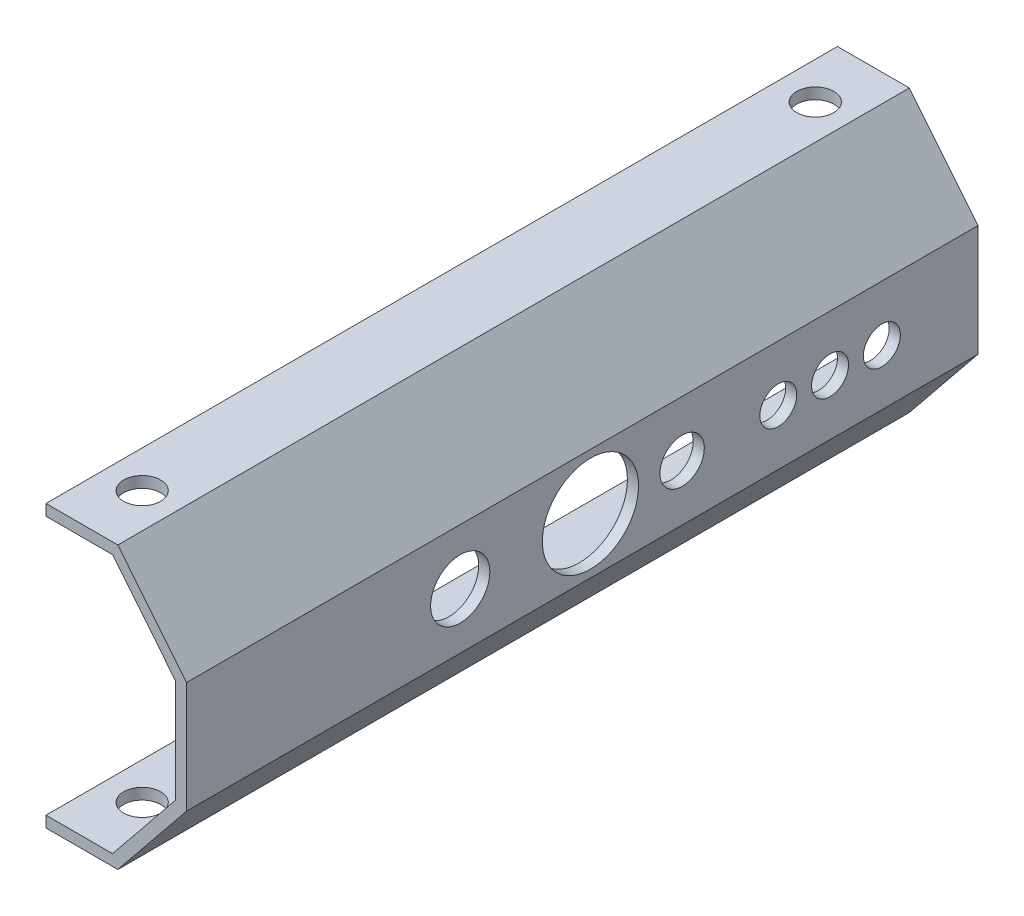
ISO-10303-21;
HEADER;
FILE_DESCRIPTION(('STEP AP214'),'2;1');
FILE_NAME('part.step','',(''),(''),'','','');
FILE_SCHEMA(('AUTOMOTIVE_DESIGN { 1 0 10303 214 1 1 1 1 }'));
ENDSEC;
DATA;
#1=APPLICATION_CONTEXT('core data for automotive mechanical design processes');
#2=APPLICATION_PROTOCOL_DEFINITION('international standard','automotive_design',2000,#1);
#3=PRODUCT_CONTEXT('',#1,'mechanical');
#4=PRODUCT('Part','Part','',(#3));
#5=PRODUCT_RELATED_PRODUCT_CATEGORY('part','',(#4));
#6=PRODUCT_DEFINITION_FORMATION('','',#4);
#7=PRODUCT_DEFINITION_CONTEXT('part definition',#1,'design');
#8=PRODUCT_DEFINITION('design','',#6,#7);
#9=PRODUCT_DEFINITION_SHAPE('','',#8);
#10=(LENGTH_UNIT() NAMED_UNIT(*) SI_UNIT(.MILLI.,.METRE.));
#11=(NAMED_UNIT(*) PLANE_ANGLE_UNIT() SI_UNIT($,.RADIAN.));
#12=(NAMED_UNIT(*) SI_UNIT($,.STERADIAN.) SOLID_ANGLE_UNIT());
#13=UNCERTAINTY_MEASURE_WITH_UNIT(LENGTH_MEASURE(1.E-05),#10,'distance_accuracy_value','');
#14=(GEOMETRIC_REPRESENTATION_CONTEXT(3) GLOBAL_UNCERTAINTY_ASSIGNED_CONTEXT((#13)) GLOBAL_UNIT_ASSIGNED_CONTEXT((#10,
#11,#12)) REPRESENTATION_CONTEXT('',''));
#15=CARTESIAN_POINT('',(0.,0.,0.));
#16=DIRECTION('',(0.,0.,1.));
#17=DIRECTION('',(1.,0.,0.));
#18=AXIS2_PLACEMENT_3D('',#15,#16,#17);
#19=CARTESIAN_POINT('',(0.,0.,107.));
#20=DIRECTION('',(1.,0.,0.));
#21=DIRECTION('',(0.,0.,-1.));
#22=AXIS2_PLACEMENT_3D('',#19,#20,#21);
#23=PLANE('',#22);
#24=DIRECTION('',(0.,-1.,0.));
#25=VECTOR('',#24,1.);
#26=CARTESIAN_POINT('',(0.,0.,0.));
#27=LINE('',#26,#25);
#28=CARTESIAN_POINT('',(0.,0.,0.));
#29=VERTEX_POINT('',#28);
#30=CARTESIAN_POINT('',(0.,-1.5,0.));
#31=VERTEX_POINT('',#30);
#32=EDGE_CURVE('E155',#29,#31,#27,.T.);
#33=ORIENTED_EDGE('',*,*,#32,.T.);
#34=DIRECTION('',(0.,0.,-1.));
#35=VECTOR('',#34,1.);
#36=CARTESIAN_POINT('',(0.,-1.5,107.));
#37=LINE('',#36,#35);
#38=CARTESIAN_POINT('',(0.,-1.5,107.));
#39=VERTEX_POINT('',#38);
#40=EDGE_CURVE('E11',#39,#31,#37,.T.);
#41=ORIENTED_EDGE('',*,*,#40,.F.);
#42=DIRECTION('',(0.,-1.,0.));
#43=VECTOR('',#42,1.);
#44=CARTESIAN_POINT('',(0.,0.,107.));
#45=LINE('',#44,#43);
#46=CARTESIAN_POINT('',(0.,0.,107.));
#47=VERTEX_POINT('',#46);
#48=EDGE_CURVE('E178',#47,#39,#45,.T.);
#49=ORIENTED_EDGE('',*,*,#48,.F.);
#50=DIRECTION('',(0.,0.,-1.));
#51=VECTOR('',#50,1.);
#52=CARTESIAN_POINT('',(0.,0.,107.));
#53=LINE('',#52,#51);
#54=EDGE_CURVE('E151',#47,#29,#53,.T.);
#55=ORIENTED_EDGE('',*,*,#54,.T.);
#56=EDGE_LOOP('',(#33,#41,#49,#55));
#57=FACE_BOUND('',#56,.T.);
#58=ADVANCED_FACE('F35',(#57),#23,.F.);
#59=CARTESIAN_POINT('',(0.,-1.5,107.));
#60=DIRECTION('',(0.,1.,0.));
#61=DIRECTION('',(0.,0.,1.));
#62=AXIS2_PLACEMENT_3D('',#59,#60,#61);
#63=PLANE('',#62);
#64=CARTESIAN_POINT('',(4.99999999999999,-1.5,99.));
#65=DIRECTION('',(0.,-1.,0.));
#66=DIRECTION('',(0.,0.,1.));
#67=AXIS2_PLACEMENT_3D('',#64,#65,#66);
#68=CIRCLE('',#67,2.5);
#69=CARTESIAN_POINT('',(4.99999999999999,-1.5,101.5));
#70=VERTEX_POINT('',#69);
#71=EDGE_CURVE('E318',#70,#70,#68,.T.);
#72=ORIENTED_EDGE('',*,*,#71,.F.);
#73=EDGE_LOOP('',(#72));
#74=FACE_BOUND('',#73,.T.);
#75=CARTESIAN_POINT('',(5.,-1.5,7.99999999999999));
#76=DIRECTION('',(0.,-1.,0.));
#77=DIRECTION('',(0.,0.,-1.));
#78=AXIS2_PLACEMENT_3D('',#75,#76,#77);
#79=CIRCLE('',#78,2.5);
#80=CARTESIAN_POINT('',(5.,-1.5,5.49999999999999));
#81=VERTEX_POINT('',#80);
#82=EDGE_CURVE('E331',#81,#81,#79,.T.);
#83=ORIENTED_EDGE('',*,*,#82,.F.);
#84=EDGE_LOOP('',(#83));
#85=FACE_BOUND('',#84,.T.);
#86=DIRECTION('',(1.,0.,0.));
#87=VECTOR('',#86,1.);
#88=CARTESIAN_POINT('',(0.,-1.5,0.));
#89=LINE('',#88,#87);
#90=CARTESIAN_POINT('',(9.7156080123009,-1.5,0.));
#91=VERTEX_POINT('',#90);
#92=EDGE_CURVE('E158',#31,#91,#89,.T.);
#93=ORIENTED_EDGE('',*,*,#92,.T.);
#94=DIRECTION('',(0.,0.,-1.));
#95=VECTOR('',#94,1.);
#96=CARTESIAN_POINT('',(9.7156080123009,-1.5,107.));
#97=LINE('',#96,#95);
#98=CARTESIAN_POINT('',(9.7156080123009,-1.5,107.));
#99=VERTEX_POINT('',#98);
#100=EDGE_CURVE('E43',#99,#91,#97,.T.);
#101=ORIENTED_EDGE('',*,*,#100,.F.);
#102=DIRECTION('',(1.,0.,0.));
#103=VECTOR('',#102,1.);
#104=CARTESIAN_POINT('',(0.,-1.5,107.));
#105=LINE('',#104,#103);
#106=EDGE_CURVE('E106',#39,#99,#105,.T.);
#107=ORIENTED_EDGE('',*,*,#106,.F.);
#108=ORIENTED_EDGE('',*,*,#40,.T.);
#109=EDGE_LOOP('',(#93,#101,#107,#108));
#110=FACE_BOUND('',#109,.T.);
#111=ADVANCED_FACE('F259',(#74,#85,#110),#63,.F.);
#112=CARTESIAN_POINT('',(9.7156080123009,-1.5,107.));
#113=DIRECTION('',(-0.777244870707486,0.629198228667964,0.));
#114=DIRECTION('',(-0.629198228667964,-0.777244870707486,0.));
#115=AXIS2_PLACEMENT_3D('',#112,#113,#114);
#116=PLANE('',#115);
#117=DIRECTION('',(0.629198228667964,0.777244870707486,0.));
#118=VECTOR('',#117,1.);
#119=CARTESIAN_POINT('',(9.7156080123009,-1.5,0.));
#120=LINE('',#119,#118);
#121=CARTESIAN_POINT('',(19.,9.96895480833419,0.));
#122=VERTEX_POINT('',#121);
#123=EDGE_CURVE('E161',#91,#122,#120,.T.);
#124=ORIENTED_EDGE('',*,*,#123,.T.);
#125=DIRECTION('',(0.,0.,-1.));
#126=VECTOR('',#125,1.);
#127=CARTESIAN_POINT('',(19.,9.96895480833419,107.));
#128=LINE('',#127,#126);
#129=CARTESIAN_POINT('',(19.,9.96895480833419,107.));
#130=VERTEX_POINT('',#129);
#131=EDGE_CURVE('E197',#130,#122,#128,.T.);
#132=ORIENTED_EDGE('',*,*,#131,.F.);
#133=DIRECTION('',(0.629198228667964,0.777244870707486,0.));
#134=VECTOR('',#133,1.);
#135=CARTESIAN_POINT('',(9.7156080123009,-1.5,107.));
#136=LINE('',#135,#134);
#137=EDGE_CURVE('E205',#99,#130,#136,.T.);
#138=ORIENTED_EDGE('',*,*,#137,.F.);
#139=ORIENTED_EDGE('',*,*,#100,.T.);
#140=EDGE_LOOP('',(#124,#132,#138,#139));
#141=FACE_BOUND('',#140,.T.);
#142=ADVANCED_FACE('F203',(#141),#116,.F.);
#143=CARTESIAN_POINT('',(19.,9.96895480833419,107.));
#144=DIRECTION('',(-1.,0.,0.));
#145=DIRECTION('',(0.,0.,1.));
#146=AXIS2_PLACEMENT_3D('',#143,#144,#145);
#147=PLANE('',#146);
#148=CARTESIAN_POINT('',(19.,17.5039548083342,13.));
#149=DIRECTION('',(1.,0.,0.));
#150=DIRECTION('',(0.,0.,-1.));
#151=AXIS2_PLACEMENT_3D('',#148,#149,#150);
#152=CIRCLE('',#151,2.5);
#153=CARTESIAN_POINT('',(19.,17.5039548083342,10.5));
#154=VERTEX_POINT('',#153);
#155=EDGE_CURVE('E400',#154,#154,#152,.T.);
#156=ORIENTED_EDGE('',*,*,#155,.F.);
#157=EDGE_LOOP('',(#156));
#158=FACE_BOUND('',#157,.T.);
#159=CARTESIAN_POINT('',(19.,17.5039548083342,20.));
#160=DIRECTION('',(1.,0.,0.));
#161=DIRECTION('',(0.,0.,-1.));
#162=AXIS2_PLACEMENT_3D('',#159,#160,#161);
#163=CIRCLE('',#162,2.5);
#164=CARTESIAN_POINT('',(19.,17.5039548083342,17.5));
#165=VERTEX_POINT('',#164);
#166=EDGE_CURVE('E401',#165,#165,#163,.T.);
#167=ORIENTED_EDGE('',*,*,#166,.F.);
#168=EDGE_LOOP('',(#167));
#169=FACE_BOUND('',#168,.T.);
#170=CARTESIAN_POINT('',(19.,17.5039548083342,27.));
#171=DIRECTION('',(1.,0.,0.));
#172=DIRECTION('',(0.,0.,-1.));
#173=AXIS2_PLACEMENT_3D('',#170,#171,#172);
#174=CIRCLE('',#173,2.5);
#175=CARTESIAN_POINT('',(19.,17.5039548083342,24.5));
#176=VERTEX_POINT('',#175);
#177=EDGE_CURVE('E408',#176,#176,#174,.T.);
#178=ORIENTED_EDGE('',*,*,#177,.F.);
#179=EDGE_LOOP('',(#178));
#180=FACE_BOUND('',#179,.T.);
#181=CARTESIAN_POINT('',(19.,17.5010451916658,52.3956508426409));
#182=DIRECTION('',(1.,0.,0.));
#183=DIRECTION('',(0.,0.,-1.));
#184=AXIS2_PLACEMENT_3D('',#181,#182,#183);
#185=CIRCLE('',#184,6.5);
#186=CARTESIAN_POINT('',(19.,17.5010451916658,45.8956508426409));
#187=VERTEX_POINT('',#186);
#188=EDGE_CURVE('E412',#187,#187,#185,.T.);
#189=ORIENTED_EDGE('',*,*,#188,.F.);
#190=EDGE_LOOP('',(#189));
#191=FACE_BOUND('',#190,.T.);
#192=CARTESIAN_POINT('',(19.,17.5,70.));
#193=DIRECTION('',(1.,0.,0.));
#194=DIRECTION('',(0.,0.,-1.));
#195=AXIS2_PLACEMENT_3D('',#192,#193,#194);
#196=CIRCLE('',#195,4.00000000000001);
#197=CARTESIAN_POINT('',(19.,17.5,66.));
#198=VERTEX_POINT('',#197);
#199=EDGE_CURVE('E325',#198,#198,#196,.T.);
#200=ORIENTED_EDGE('',*,*,#199,.F.);
#201=EDGE_LOOP('',(#200));
#202=FACE_BOUND('',#201,.T.);
#203=CARTESIAN_POINT('',(19.,17.5,40.));
#204=DIRECTION('',(1.,0.,0.));
#205=DIRECTION('',(0.,0.,-1.));
#206=AXIS2_PLACEMENT_3D('',#203,#204,#205);
#207=CIRCLE('',#206,3.);
#208=CARTESIAN_POINT('',(19.,17.5,37.));
#209=VERTEX_POINT('',#208);
#210=EDGE_CURVE('E319',#209,#209,#207,.T.);
#211=ORIENTED_EDGE('',*,*,#210,.F.);
#212=EDGE_LOOP('',(#211));
#213=FACE_BOUND('',#212,.T.);
#214=DIRECTION('',(0.,1.,0.));
#215=VECTOR('',#214,1.);
#216=CARTESIAN_POINT('',(19.,9.96895480833419,0.));
#217=LINE('',#216,#215);
#218=CARTESIAN_POINT('',(19.,25.0310451916658,0.));
#219=VERTEX_POINT('',#218);
#220=EDGE_CURVE('E163',#122,#219,#217,.T.);
#221=ORIENTED_EDGE('',*,*,#220,.T.);
#222=DIRECTION('',(0.,0.,-1.));
#223=VECTOR('',#222,1.);
#224=CARTESIAN_POINT('',(19.,25.0310451916658,107.));
#225=LINE('',#224,#223);
#226=CARTESIAN_POINT('',(19.,25.0310451916658,107.));
#227=VERTEX_POINT('',#226);
#228=EDGE_CURVE('E194',#227,#219,#225,.T.);
#229=ORIENTED_EDGE('',*,*,#228,.F.);
#230=DIRECTION('',(0.,1.,0.));
#231=VECTOR('',#230,1.);
#232=CARTESIAN_POINT('',(19.,9.96895480833419,107.));
#233=LINE('',#232,#231);
#234=EDGE_CURVE('E223',#130,#227,#233,.T.);
#235=ORIENTED_EDGE('',*,*,#234,.F.);
#236=ORIENTED_EDGE('',*,*,#131,.T.);
#237=EDGE_LOOP('',(#221,#229,#235,#236));
#238=FACE_BOUND('',#237,.T.);
#239=ADVANCED_FACE('F214',(#158,#169,#180,#191,#202,#213,#238),#147,.F.);
#240=CARTESIAN_POINT('',(9.7156080123009,36.5,107.));
#241=DIRECTION('',(-0.777244870707485,-0.629198228667965,0.));
#242=DIRECTION('',(0.629198228667965,-0.777244870707485,0.));
#243=AXIS2_PLACEMENT_3D('',#240,#241,#242);
#244=PLANE('',#243);
#245=DIRECTION('',(-0.629198228667965,0.777244870707485,0.));
#246=VECTOR('',#245,1.);
#247=CARTESIAN_POINT('',(9.7156080123009,36.5,0.));
#248=LINE('',#247,#246);
#249=CARTESIAN_POINT('',(9.7156080123009,36.5,0.));
#250=VERTEX_POINT('',#249);
#251=EDGE_CURVE('E165',#219,#250,#248,.T.);
#252=ORIENTED_EDGE('',*,*,#251,.T.);
#253=DIRECTION('',(0.,0.,-1.));
#254=VECTOR('',#253,1.);
#255=CARTESIAN_POINT('',(9.7156080123009,36.5,107.));
#256=LINE('',#255,#254);
#257=CARTESIAN_POINT('',(9.7156080123009,36.5,107.));
#258=VERTEX_POINT('',#257);
#259=EDGE_CURVE('E191',#258,#250,#256,.T.);
#260=ORIENTED_EDGE('',*,*,#259,.F.);
#261=DIRECTION('',(-0.629198228667965,0.777244870707485,0.));
#262=VECTOR('',#261,1.);
#263=CARTESIAN_POINT('',(9.7156080123009,36.5,107.));
#264=LINE('',#263,#262);
#265=EDGE_CURVE('E220',#227,#258,#264,.T.);
#266=ORIENTED_EDGE('',*,*,#265,.F.);
#267=ORIENTED_EDGE('',*,*,#228,.T.);
#268=EDGE_LOOP('',(#252,#260,#266,#267));
#269=FACE_BOUND('',#268,.T.);
#270=ADVANCED_FACE('F218',(#269),#244,.F.);
#271=CARTESIAN_POINT('',(0.,36.5,107.));
#272=DIRECTION('',(0.,-1.,0.));
#273=DIRECTION('',(0.,0.,-1.));
#274=AXIS2_PLACEMENT_3D('',#271,#272,#273);
#275=PLANE('',#274);
#276=CARTESIAN_POINT('',(5.00000000000001,36.5,99.));
#277=DIRECTION('',(0.,1.,0.));
#278=DIRECTION('',(0.,0.,-1.));
#279=AXIS2_PLACEMENT_3D('',#276,#277,#278);
#280=CIRCLE('',#279,2.5);
#281=CARTESIAN_POINT('',(5.00000000000001,36.5,96.5));
#282=VERTEX_POINT('',#281);
#283=EDGE_CURVE('E337',#282,#282,#280,.T.);
#284=ORIENTED_EDGE('',*,*,#283,.F.);
#285=EDGE_LOOP('',(#284));
#286=FACE_BOUND('',#285,.T.);
#287=CARTESIAN_POINT('',(5.,36.5,7.99999999999999));
#288=DIRECTION('',(0.,1.,0.));
#289=DIRECTION('',(0.,0.,1.));
#290=AXIS2_PLACEMENT_3D('',#287,#288,#289);
#291=CIRCLE('',#290,2.5);
#292=CARTESIAN_POINT('',(5.,36.5,10.5));
#293=VERTEX_POINT('',#292);
#294=EDGE_CURVE('E343',#293,#293,#291,.T.);
#295=ORIENTED_EDGE('',*,*,#294,.F.);
#296=EDGE_LOOP('',(#295));
#297=FACE_BOUND('',#296,.T.);
#298=DIRECTION('',(-1.,0.,0.));
#299=VECTOR('',#298,1.);
#300=CARTESIAN_POINT('',(0.,36.5,0.));
#301=LINE('',#300,#299);
#302=CARTESIAN_POINT('',(0.,36.5,0.));
#303=VERTEX_POINT('',#302);
#304=EDGE_CURVE('E167',#250,#303,#301,.T.);
#305=ORIENTED_EDGE('',*,*,#304,.T.);
#306=DIRECTION('',(0.,0.,-1.));
#307=VECTOR('',#306,1.);
#308=CARTESIAN_POINT('',(0.,36.5,107.));
#309=LINE('',#308,#307);
#310=CARTESIAN_POINT('',(0.,36.5,107.));
#311=VERTEX_POINT('',#310);
#312=EDGE_CURVE('E188',#311,#303,#309,.T.);
#313=ORIENTED_EDGE('',*,*,#312,.F.);
#314=DIRECTION('',(-1.,0.,0.));
#315=VECTOR('',#314,1.);
#316=CARTESIAN_POINT('',(0.,36.5,107.));
#317=LINE('',#316,#315);
#318=EDGE_CURVE('E222',#258,#311,#317,.T.);
#319=ORIENTED_EDGE('',*,*,#318,.F.);
#320=ORIENTED_EDGE('',*,*,#259,.T.);
#321=EDGE_LOOP('',(#305,#313,#319,#320));
#322=FACE_BOUND('',#321,.T.);
#323=ADVANCED_FACE('F276',(#286,#297,#322),#275,.F.);
#324=CARTESIAN_POINT('',(0.,36.5,107.));
#325=DIRECTION('',(1.,0.,0.));
#326=DIRECTION('',(0.,1.,0.));
#327=AXIS2_PLACEMENT_3D('',#324,#325,#326);
#328=PLANE('',#327);
#329=DIRECTION('',(0.,-1.,0.));
#330=VECTOR('',#329,1.);
#331=CARTESIAN_POINT('',(0.,36.5,0.));
#332=LINE('',#331,#330);
#333=CARTESIAN_POINT('',(0.,35.,0.));
#334=VERTEX_POINT('',#333);
#335=EDGE_CURVE('E169',#303,#334,#332,.T.);
#336=ORIENTED_EDGE('',*,*,#335,.T.);
#337=DIRECTION('',(0.,0.,-1.));
#338=VECTOR('',#337,1.);
#339=CARTESIAN_POINT('',(0.,35.,107.));
#340=LINE('',#339,#338);
#341=CARTESIAN_POINT('',(0.,35.,107.));
#342=VERTEX_POINT('',#341);
#343=EDGE_CURVE('E185',#342,#334,#340,.T.);
#344=ORIENTED_EDGE('',*,*,#343,.F.);
#345=DIRECTION('',(0.,-1.,0.));
#346=VECTOR('',#345,1.);
#347=CARTESIAN_POINT('',(0.,36.5,107.));
#348=LINE('',#347,#346);
#349=EDGE_CURVE('E225',#311,#342,#348,.T.);
#350=ORIENTED_EDGE('',*,*,#349,.F.);
#351=ORIENTED_EDGE('',*,*,#312,.T.);
#352=EDGE_LOOP('',(#336,#344,#350,#351));
#353=FACE_BOUND('',#352,.T.);
#354=ADVANCED_FACE('F279',(#353),#328,.F.);
#355=CARTESIAN_POINT('',(0.,35.,107.));
#356=DIRECTION('',(0.,1.,0.));
#357=DIRECTION('',(-1.,0.,0.));
#358=AXIS2_PLACEMENT_3D('',#355,#356,#357);
#359=PLANE('',#358);
#360=CARTESIAN_POINT('',(5.00000000000001,35.,99.));
#361=DIRECTION('',(0.,1.,0.));
#362=DIRECTION('',(-1.,0.,0.));
#363=AXIS2_PLACEMENT_3D('',#360,#361,#362);
#364=CIRCLE('',#363,2.5);
#365=CARTESIAN_POINT('',(2.50000000000001,35.,99.));
#366=VERTEX_POINT('',#365);
#367=EDGE_CURVE('E340',#366,#366,#364,.F.);
#368=ORIENTED_EDGE('',*,*,#367,.F.);
#369=EDGE_LOOP('',(#368));
#370=FACE_BOUND('',#369,.T.);
#371=CARTESIAN_POINT('',(5.,35.,7.99999999999999));
#372=DIRECTION('',(0.,1.,0.));
#373=DIRECTION('',(-1.,0.,0.));
#374=AXIS2_PLACEMENT_3D('',#371,#372,#373);
#375=CIRCLE('',#374,2.5);
#376=CARTESIAN_POINT('',(2.5,35.,7.99999999999999));
#377=VERTEX_POINT('',#376);
#378=EDGE_CURVE('E159',#377,#377,#375,.F.);
#379=ORIENTED_EDGE('',*,*,#378,.F.);
#380=EDGE_LOOP('',(#379));
#381=FACE_BOUND('',#380,.T.);
#382=DIRECTION('',(1.,0.,0.));
#383=VECTOR('',#382,1.);
#384=CARTESIAN_POINT('',(0.,35.,0.));
#385=LINE('',#384,#383);
#386=CARTESIAN_POINT('',(9.,35.,0.));
#387=VERTEX_POINT('',#386);
#388=EDGE_CURVE('E171',#334,#387,#385,.T.);
#389=ORIENTED_EDGE('',*,*,#388,.T.);
#390=DIRECTION('',(0.,0.,-1.));
#391=VECTOR('',#390,1.);
#392=CARTESIAN_POINT('',(9.,35.,107.));
#393=LINE('',#392,#391);
#394=CARTESIAN_POINT('',(9.,35.,107.));
#395=VERTEX_POINT('',#394);
#396=EDGE_CURVE('E182',#395,#387,#393,.T.);
#397=ORIENTED_EDGE('',*,*,#396,.F.);
#398=DIRECTION('',(1.,0.,0.));
#399=VECTOR('',#398,1.);
#400=CARTESIAN_POINT('',(0.,35.,107.));
#401=LINE('',#400,#399);
#402=EDGE_CURVE('E231',#342,#395,#401,.T.);
#403=ORIENTED_EDGE('',*,*,#402,.F.);
#404=ORIENTED_EDGE('',*,*,#343,.T.);
#405=EDGE_LOOP('',(#389,#397,#403,#404));
#406=FACE_BOUND('',#405,.T.);
#407=ADVANCED_FACE('F237',(#370,#381,#406),#359,.F.);
#408=CARTESIAN_POINT('',(9.,35.,107.));
#409=DIRECTION('',(0.777244870707486,0.629198228667965,0.));
#410=DIRECTION('',(-0.629198228667965,0.777244870707486,0.));
#411=AXIS2_PLACEMENT_3D('',#408,#409,#410);
#412=PLANE('',#411);
#413=DIRECTION('',(0.629198228667964,-0.777244870707485,0.));
#414=VECTOR('',#413,1.);
#415=CARTESIAN_POINT('',(9.,35.,0.));
#416=LINE('',#415,#414);
#417=CARTESIAN_POINT('',(17.5,24.5,0.));
#418=VERTEX_POINT('',#417);
#419=EDGE_CURVE('E173',#387,#418,#416,.T.);
#420=ORIENTED_EDGE('',*,*,#419,.T.);
#421=DIRECTION('',(0.,0.,-1.));
#422=VECTOR('',#421,1.);
#423=CARTESIAN_POINT('',(17.5,24.5,107.));
#424=LINE('',#423,#422);
#425=CARTESIAN_POINT('',(17.5,24.5,107.));
#426=VERTEX_POINT('',#425);
#427=EDGE_CURVE('E146',#426,#418,#424,.T.);
#428=ORIENTED_EDGE('',*,*,#427,.F.);
#429=DIRECTION('',(0.629198228667964,-0.777244870707485,0.));
#430=VECTOR('',#429,1.);
#431=CARTESIAN_POINT('',(9.,35.,107.));
#432=LINE('',#431,#430);
#433=EDGE_CURVE('E137',#395,#426,#432,.T.);
#434=ORIENTED_EDGE('',*,*,#433,.F.);
#435=ORIENTED_EDGE('',*,*,#396,.T.);
#436=EDGE_LOOP('',(#420,#428,#434,#435));
#437=FACE_BOUND('',#436,.T.);
#438=ADVANCED_FACE('F241',(#437),#412,.F.);
#439=CARTESIAN_POINT('',(17.5,10.5,107.));
#440=DIRECTION('',(1.,0.,0.));
#441=DIRECTION('',(0.,0.,-1.));
#442=AXIS2_PLACEMENT_3D('',#439,#440,#441);
#443=PLANE('',#442);
#444=CARTESIAN_POINT('',(17.5,17.5039548083342,13.));
#445=DIRECTION('',(1.,0.,0.));
#446=DIRECTION('',(0.,0.,-1.));
#447=AXIS2_PLACEMENT_3D('',#444,#445,#446);
#448=CIRCLE('',#447,2.5);
#449=CARTESIAN_POINT('',(17.5,17.5039548083342,10.5));
#450=VERTEX_POINT('',#449);
#451=EDGE_CURVE('E297',#450,#450,#448,.F.);
#452=ORIENTED_EDGE('',*,*,#451,.F.);
#453=EDGE_LOOP('',(#452));
#454=FACE_BOUND('',#453,.T.);
#455=CARTESIAN_POINT('',(17.5,17.5039548083342,20.));
#456=DIRECTION('',(1.,0.,0.));
#457=DIRECTION('',(0.,0.,-1.));
#458=AXIS2_PLACEMENT_3D('',#455,#456,#457);
#459=CIRCLE('',#458,2.5);
#460=CARTESIAN_POINT('',(17.5,17.5039548083342,17.5));
#461=VERTEX_POINT('',#460);
#462=EDGE_CURVE('E301',#461,#461,#459,.F.);
#463=ORIENTED_EDGE('',*,*,#462,.F.);
#464=EDGE_LOOP('',(#463));
#465=FACE_BOUND('',#464,.T.);
#466=CARTESIAN_POINT('',(17.5,17.5039548083342,27.));
#467=DIRECTION('',(1.,0.,0.));
#468=DIRECTION('',(0.,0.,-1.));
#469=AXIS2_PLACEMENT_3D('',#466,#467,#468);
#470=CIRCLE('',#469,2.5);
#471=CARTESIAN_POINT('',(17.5,17.5039548083342,24.5));
#472=VERTEX_POINT('',#471);
#473=EDGE_CURVE('E305',#472,#472,#470,.F.);
#474=ORIENTED_EDGE('',*,*,#473,.F.);
#475=EDGE_LOOP('',(#474));
#476=FACE_BOUND('',#475,.T.);
#477=CARTESIAN_POINT('',(17.5,17.5010451916658,52.3956508426409));
#478=DIRECTION('',(1.,0.,0.));
#479=DIRECTION('',(0.,0.,-1.));
#480=AXIS2_PLACEMENT_3D('',#477,#478,#479);
#481=CIRCLE('',#480,6.5);
#482=CARTESIAN_POINT('',(17.5,17.5010451916658,45.8956508426409));
#483=VERTEX_POINT('',#482);
#484=EDGE_CURVE('E309',#483,#483,#481,.F.);
#485=ORIENTED_EDGE('',*,*,#484,.F.);
#486=EDGE_LOOP('',(#485));
#487=FACE_BOUND('',#486,.T.);
#488=CARTESIAN_POINT('',(17.5,17.5,70.));
#489=DIRECTION('',(1.,0.,0.));
#490=DIRECTION('',(0.,0.,-1.));
#491=AXIS2_PLACEMENT_3D('',#488,#489,#490);
#492=CIRCLE('',#491,4.00000000000001);
#493=CARTESIAN_POINT('',(17.5,17.5,66.));
#494=VERTEX_POINT('',#493);
#495=EDGE_CURVE('E313',#494,#494,#492,.F.);
#496=ORIENTED_EDGE('',*,*,#495,.F.);
#497=EDGE_LOOP('',(#496));
#498=FACE_BOUND('',#497,.T.);
#499=CARTESIAN_POINT('',(17.5,17.5,40.));
#500=DIRECTION('',(1.,0.,0.));
#501=DIRECTION('',(0.,0.,-1.));
#502=AXIS2_PLACEMENT_3D('',#499,#500,#501);
#503=CIRCLE('',#502,3.);
#504=CARTESIAN_POINT('',(17.5,17.5,37.));
#505=VERTEX_POINT('',#504);
#506=EDGE_CURVE('E316',#505,#505,#503,.F.);
#507=ORIENTED_EDGE('',*,*,#506,.F.);
#508=EDGE_LOOP('',(#507));
#509=FACE_BOUND('',#508,.T.);
#510=DIRECTION('',(0.,-1.,0.));
#511=VECTOR('',#510,1.);
#512=CARTESIAN_POINT('',(17.5,10.5,0.));
#513=LINE('',#512,#511);
#514=CARTESIAN_POINT('',(17.5,10.5,0.));
#515=VERTEX_POINT('',#514);
#516=EDGE_CURVE('E145',#418,#515,#513,.T.);
#517=ORIENTED_EDGE('',*,*,#516,.T.);
#518=DIRECTION('',(0.,0.,-1.));
#519=VECTOR('',#518,1.);
#520=CARTESIAN_POINT('',(17.5,10.5,107.));
#521=LINE('',#520,#519);
#522=CARTESIAN_POINT('',(17.5,10.5,107.));
#523=VERTEX_POINT('',#522);
#524=EDGE_CURVE('E142',#523,#515,#521,.T.);
#525=ORIENTED_EDGE('',*,*,#524,.F.);
#526=DIRECTION('',(0.,-1.,0.));
#527=VECTOR('',#526,1.);
#528=CARTESIAN_POINT('',(17.5,10.5,107.));
#529=LINE('',#528,#527);
#530=EDGE_CURVE('E131',#426,#523,#529,.T.);
#531=ORIENTED_EDGE('',*,*,#530,.F.);
#532=ORIENTED_EDGE('',*,*,#427,.T.);
#533=EDGE_LOOP('',(#517,#525,#531,#532));
#534=FACE_BOUND('',#533,.T.);
#535=ADVANCED_FACE('F143',(#454,#465,#476,#487,#498,#509,#534),#443,.F.);
#536=CARTESIAN_POINT('',(9.,0.,107.));
#537=DIRECTION('',(0.777244870707486,-0.629198228667964,0.));
#538=DIRECTION('',(0.629198228667964,0.777244870707486,0.));
#539=AXIS2_PLACEMENT_3D('',#536,#537,#538);
#540=PLANE('',#539);
#541=DIRECTION('',(-0.629198228667964,-0.777244870707486,0.));
#542=VECTOR('',#541,1.);
#543=CARTESIAN_POINT('',(9.,0.,0.));
#544=LINE('',#543,#542);
#545=CARTESIAN_POINT('',(9.,0.,0.));
#546=VERTEX_POINT('',#545);
#547=EDGE_CURVE('E92',#515,#546,#544,.T.);
#548=ORIENTED_EDGE('',*,*,#547,.T.);
#549=DIRECTION('',(0.,0.,-1.));
#550=VECTOR('',#549,1.);
#551=CARTESIAN_POINT('',(9.,0.,107.));
#552=LINE('',#551,#550);
#553=CARTESIAN_POINT('',(9.,0.,107.));
#554=VERTEX_POINT('',#553);
#555=EDGE_CURVE('E147',#554,#546,#552,.T.);
#556=ORIENTED_EDGE('',*,*,#555,.F.);
#557=DIRECTION('',(-0.629198228667964,-0.777244870707486,0.));
#558=VECTOR('',#557,1.);
#559=CARTESIAN_POINT('',(9.,0.,107.));
#560=LINE('',#559,#558);
#561=EDGE_CURVE('E135',#523,#554,#560,.T.);
#562=ORIENTED_EDGE('',*,*,#561,.F.);
#563=ORIENTED_EDGE('',*,*,#524,.T.);
#564=EDGE_LOOP('',(#548,#556,#562,#563));
#565=FACE_BOUND('',#564,.T.);
#566=ADVANCED_FACE('F149',(#565),#540,.F.);
#567=CARTESIAN_POINT('',(0.,0.,107.));
#568=DIRECTION('',(0.,-1.,0.));
#569=DIRECTION('',(0.,0.,-1.));
#570=AXIS2_PLACEMENT_3D('',#567,#568,#569);
#571=PLANE('',#570);
#572=CARTESIAN_POINT('',(4.99999999999999,0.,99.));
#573=DIRECTION('',(0.,-1.,0.));
#574=DIRECTION('',(0.,0.,-1.));
#575=AXIS2_PLACEMENT_3D('',#572,#573,#574);
#576=CIRCLE('',#575,2.5);
#577=CARTESIAN_POINT('',(4.99999999999999,0.,96.5));
#578=VERTEX_POINT('',#577);
#579=EDGE_CURVE('E322',#578,#578,#576,.F.);
#580=ORIENTED_EDGE('',*,*,#579,.F.);
#581=EDGE_LOOP('',(#580));
#582=FACE_BOUND('',#581,.T.);
#583=CARTESIAN_POINT('',(5.,0.,7.99999999999999));
#584=DIRECTION('',(0.,-1.,0.));
#585=DIRECTION('',(0.,0.,-1.));
#586=AXIS2_PLACEMENT_3D('',#583,#584,#585);
#587=CIRCLE('',#586,2.5);
#588=CARTESIAN_POINT('',(5.,0.,5.49999999999999));
#589=VERTEX_POINT('',#588);
#590=EDGE_CURVE('E334',#589,#589,#587,.F.);
#591=ORIENTED_EDGE('',*,*,#590,.F.);
#592=EDGE_LOOP('',(#591));
#593=FACE_BOUND('',#592,.T.);
#594=DIRECTION('',(-1.,0.,0.));
#595=VECTOR('',#594,1.);
#596=CARTESIAN_POINT('',(0.,0.,0.));
#597=LINE('',#596,#595);
#598=EDGE_CURVE('E98',#546,#29,#597,.T.);
#599=ORIENTED_EDGE('',*,*,#598,.T.);
#600=ORIENTED_EDGE('',*,*,#54,.F.);
#601=DIRECTION('',(-1.,0.,0.));
#602=VECTOR('',#601,1.);
#603=CARTESIAN_POINT('',(0.,0.,107.));
#604=LINE('',#603,#602);
#605=EDGE_CURVE('E51',#554,#47,#604,.T.);
#606=ORIENTED_EDGE('',*,*,#605,.F.);
#607=ORIENTED_EDGE('',*,*,#555,.T.);
#608=EDGE_LOOP('',(#599,#600,#606,#607));
#609=FACE_BOUND('',#608,.T.);
#610=ADVANCED_FACE('F245',(#582,#593,#609),#571,.F.);
#611=CARTESIAN_POINT('',(0.,0.,107.));
#612=DIRECTION('',(0.,0.,1.));
#613=DIRECTION('',(1.,0.,0.));
#614=AXIS2_PLACEMENT_3D('',#611,#612,#613);
#615=PLANE('',#614);
#616=ORIENTED_EDGE('',*,*,#48,.T.);
#617=ORIENTED_EDGE('',*,*,#106,.T.);
#618=ORIENTED_EDGE('',*,*,#137,.T.);
#619=ORIENTED_EDGE('',*,*,#234,.T.);
#620=ORIENTED_EDGE('',*,*,#265,.T.);
#621=ORIENTED_EDGE('',*,*,#318,.T.);
#622=ORIENTED_EDGE('',*,*,#349,.T.);
#623=ORIENTED_EDGE('',*,*,#402,.T.);
#624=ORIENTED_EDGE('',*,*,#433,.T.);
#625=ORIENTED_EDGE('',*,*,#530,.T.);
#626=ORIENTED_EDGE('',*,*,#561,.T.);
#627=ORIENTED_EDGE('',*,*,#605,.T.);
#628=EDGE_LOOP('',(#616,#617,#618,#619,#620,#621,#622,#623,#624,#625,#626,#627));
#629=FACE_BOUND('',#628,.T.);
#630=ADVANCED_FACE('F133',(#629),#615,.T.);
#631=CARTESIAN_POINT('',(0.,0.,0.));
#632=DIRECTION('',(0.,0.,1.));
#633=DIRECTION('',(1.,0.,0.));
#634=AXIS2_PLACEMENT_3D('',#631,#632,#633);
#635=PLANE('',#634);
#636=ORIENTED_EDGE('',*,*,#32,.F.);
#637=ORIENTED_EDGE('',*,*,#598,.F.);
#638=ORIENTED_EDGE('',*,*,#547,.F.);
#639=ORIENTED_EDGE('',*,*,#516,.F.);
#640=ORIENTED_EDGE('',*,*,#419,.F.);
#641=ORIENTED_EDGE('',*,*,#388,.F.);
#642=ORIENTED_EDGE('',*,*,#335,.F.);
#643=ORIENTED_EDGE('',*,*,#304,.F.);
#644=ORIENTED_EDGE('',*,*,#251,.F.);
#645=ORIENTED_EDGE('',*,*,#220,.F.);
#646=ORIENTED_EDGE('',*,*,#123,.F.);
#647=ORIENTED_EDGE('',*,*,#92,.F.);
#648=EDGE_LOOP('',(#636,#637,#638,#639,#640,#641,#642,#643,#644,#645,#646,#647));
#649=FACE_BOUND('',#648,.T.);
#650=ADVANCED_FACE('F209',(#649),#635,.F.);
#651=CARTESIAN_POINT('',(5.,-1.501,7.99999999999999));
#652=DIRECTION('',(0.,1.,0.));
#653=DIRECTION('',(0.,0.,1.));
#654=AXIS2_PLACEMENT_3D('',#651,#652,#653);
#655=CYLINDRICAL_SURFACE('',#654,2.5);
#656=ORIENTED_EDGE('',*,*,#294,.T.);
#657=EDGE_LOOP('',(#656));
#658=FACE_BOUND('',#657,.T.);
#659=ORIENTED_EDGE('',*,*,#378,.T.);
#660=EDGE_LOOP('',(#659));
#661=FACE_BOUND('',#660,.T.);
#662=ADVANCED_FACE('F351',(#658,#661),#655,.F.);
#663=CARTESIAN_POINT('',(5.00000000000001,-1.501,99.));
#664=DIRECTION('',(0.,1.,0.));
#665=DIRECTION('',(0.,0.,1.));
#666=AXIS2_PLACEMENT_3D('',#663,#664,#665);
#667=CYLINDRICAL_SURFACE('',#666,2.5);
#668=ORIENTED_EDGE('',*,*,#283,.T.);
#669=EDGE_LOOP('',(#668));
#670=FACE_BOUND('',#669,.T.);
#671=ORIENTED_EDGE('',*,*,#367,.T.);
#672=EDGE_LOOP('',(#671));
#673=FACE_BOUND('',#672,.T.);
#674=ADVANCED_FACE('F354',(#670,#673),#667,.F.);
#675=CARTESIAN_POINT('',(5.,36.501,7.99999999999999));
#676=DIRECTION('',(0.,-1.,0.));
#677=DIRECTION('',(0.,0.,-1.));
#678=AXIS2_PLACEMENT_3D('',#675,#676,#677);
#679=CYLINDRICAL_SURFACE('',#678,2.5);
#680=ORIENTED_EDGE('',*,*,#82,.T.);
#681=EDGE_LOOP('',(#680));
#682=FACE_BOUND('',#681,.T.);
#683=ORIENTED_EDGE('',*,*,#590,.T.);
#684=EDGE_LOOP('',(#683));
#685=FACE_BOUND('',#684,.T.);
#686=ADVANCED_FACE('F361',(#682,#685),#679,.F.);
#687=CARTESIAN_POINT('',(4.99999999999999,36.501,99.));
#688=DIRECTION('',(0.,-1.,0.));
#689=DIRECTION('',(0.,0.,-1.));
#690=AXIS2_PLACEMENT_3D('',#687,#688,#689);
#691=CYLINDRICAL_SURFACE('',#690,2.5);
#692=ORIENTED_EDGE('',*,*,#71,.T.);
#693=EDGE_LOOP('',(#692));
#694=FACE_BOUND('',#693,.T.);
#695=ORIENTED_EDGE('',*,*,#579,.T.);
#696=EDGE_LOOP('',(#695));
#697=FACE_BOUND('',#696,.T.);
#698=ADVANCED_FACE('F367',(#694,#697),#691,.F.);
#699=CARTESIAN_POINT('',(-0.00100000000000447,17.5,40.));
#700=DIRECTION('',(1.,0.,0.));
#701=DIRECTION('',(0.,0.,-1.));
#702=AXIS2_PLACEMENT_3D('',#699,#700,#701);
#703=CYLINDRICAL_SURFACE('',#702,3.);
#704=ORIENTED_EDGE('',*,*,#210,.T.);
#705=EDGE_LOOP('',(#704));
#706=FACE_BOUND('',#705,.T.);
#707=ORIENTED_EDGE('',*,*,#506,.T.);
#708=EDGE_LOOP('',(#707));
#709=FACE_BOUND('',#708,.T.);
#710=ADVANCED_FACE('F371',(#706,#709),#703,.F.);
#711=CARTESIAN_POINT('',(-0.00100000000000447,17.5,70.));
#712=DIRECTION('',(1.,0.,0.));
#713=DIRECTION('',(0.,0.,-1.));
#714=AXIS2_PLACEMENT_3D('',#711,#712,#713);
#715=CYLINDRICAL_SURFACE('',#714,4.00000000000001);
#716=ORIENTED_EDGE('',*,*,#199,.T.);
#717=EDGE_LOOP('',(#716));
#718=FACE_BOUND('',#717,.T.);
#719=ORIENTED_EDGE('',*,*,#495,.T.);
#720=EDGE_LOOP('',(#719));
#721=FACE_BOUND('',#720,.T.);
#722=ADVANCED_FACE('F375',(#718,#721),#715,.F.);
#723=CARTESIAN_POINT('',(-0.00100000000000447,17.5010451916658,52.3956508426409));
#724=DIRECTION('',(1.,0.,0.));
#725=DIRECTION('',(0.,0.,-1.));
#726=AXIS2_PLACEMENT_3D('',#723,#724,#725);
#727=CYLINDRICAL_SURFACE('',#726,6.5);
#728=ORIENTED_EDGE('',*,*,#188,.T.);
#729=EDGE_LOOP('',(#728));
#730=FACE_BOUND('',#729,.T.);
#731=ORIENTED_EDGE('',*,*,#484,.T.);
#732=EDGE_LOOP('',(#731));
#733=FACE_BOUND('',#732,.T.);
#734=ADVANCED_FACE('F379',(#730,#733),#727,.F.);
#735=CARTESIAN_POINT('',(-0.00100000000000447,17.5039548083342,27.));
#736=DIRECTION('',(1.,0.,0.));
#737=DIRECTION('',(0.,0.,-1.));
#738=AXIS2_PLACEMENT_3D('',#735,#736,#737);
#739=CYLINDRICAL_SURFACE('',#738,2.5);
#740=ORIENTED_EDGE('',*,*,#177,.T.);
#741=EDGE_LOOP('',(#740));
#742=FACE_BOUND('',#741,.T.);
#743=ORIENTED_EDGE('',*,*,#473,.T.);
#744=EDGE_LOOP('',(#743));
#745=FACE_BOUND('',#744,.T.);
#746=ADVANCED_FACE('F383',(#742,#745),#739,.F.);
#747=CARTESIAN_POINT('',(-0.00100000000000447,17.5039548083342,20.));
#748=DIRECTION('',(1.,0.,0.));
#749=DIRECTION('',(0.,0.,-1.));
#750=AXIS2_PLACEMENT_3D('',#747,#748,#749);
#751=CYLINDRICAL_SURFACE('',#750,2.5);
#752=ORIENTED_EDGE('',*,*,#166,.T.);
#753=EDGE_LOOP('',(#752));
#754=FACE_BOUND('',#753,.T.);
#755=ORIENTED_EDGE('',*,*,#462,.T.);
#756=EDGE_LOOP('',(#755));
#757=FACE_BOUND('',#756,.T.);
#758=ADVANCED_FACE('F387',(#754,#757),#751,.F.);
#759=CARTESIAN_POINT('',(-0.00100000000000447,17.5039548083342,13.));
#760=DIRECTION('',(1.,0.,0.));
#761=DIRECTION('',(0.,0.,-1.));
#762=AXIS2_PLACEMENT_3D('',#759,#760,#761);
#763=CYLINDRICAL_SURFACE('',#762,2.5);
#764=ORIENTED_EDGE('',*,*,#155,.T.);
#765=EDGE_LOOP('',(#764));
#766=FACE_BOUND('',#765,.T.);
#767=ORIENTED_EDGE('',*,*,#451,.T.);
#768=EDGE_LOOP('',(#767));
#769=FACE_BOUND('',#768,.T.);
#770=ADVANCED_FACE('F391',(#766,#769),#763,.F.);
#771=CLOSED_SHELL('',(#58,#111,#142,#239,#270,#323,#354,#407,#438,#535,#566,#610,#630,#650,#662,
#674,#686,#698,#710,#722,#734,#746,#758,#770));
#772=MANIFOLD_SOLID_BREP('B2',#771);
#773=ADVANCED_BREP_SHAPE_REPRESENTATION('',(#18,#772),#14);
#774=SHAPE_DEFINITION_REPRESENTATION(#9,#773);
ENDSEC;
END-ISO-10303-21;
